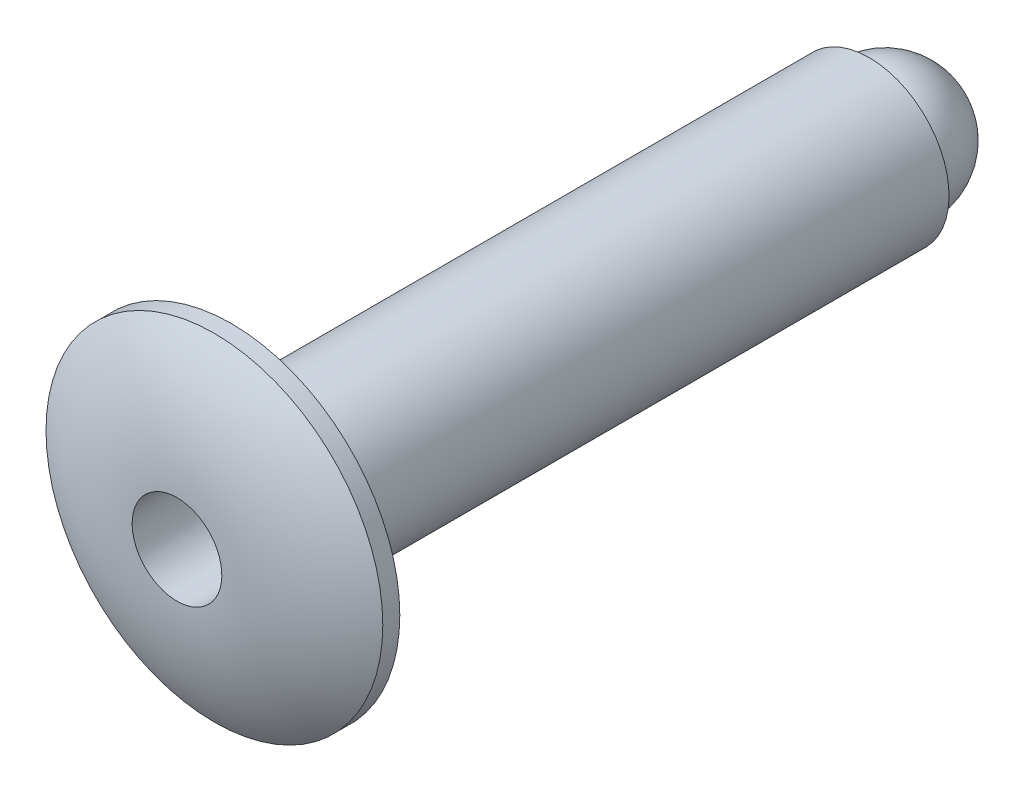
ISO-10303-21;
HEADER;
FILE_DESCRIPTION(('STEP AP214'),'2;1');
FILE_NAME('part.step','',(''),(''),'','','');
FILE_SCHEMA(('AUTOMOTIVE_DESIGN { 1 0 10303 214 1 1 1 1 }'));
ENDSEC;
DATA;
#1=APPLICATION_CONTEXT('core data for automotive mechanical design processes');
#2=APPLICATION_PROTOCOL_DEFINITION('international standard','automotive_design',2000,#1);
#3=PRODUCT_CONTEXT('',#1,'mechanical');
#4=PRODUCT('Part','Part','',(#3));
#5=PRODUCT_RELATED_PRODUCT_CATEGORY('part','',(#4));
#6=PRODUCT_DEFINITION_FORMATION('','',#4);
#7=PRODUCT_DEFINITION_CONTEXT('part definition',#1,'design');
#8=PRODUCT_DEFINITION('design','',#6,#7);
#9=PRODUCT_DEFINITION_SHAPE('','',#8);
#10=(LENGTH_UNIT() NAMED_UNIT(*) SI_UNIT(.MILLI.,.METRE.));
#11=(NAMED_UNIT(*) PLANE_ANGLE_UNIT() SI_UNIT($,.RADIAN.));
#12=(NAMED_UNIT(*) SI_UNIT($,.STERADIAN.) SOLID_ANGLE_UNIT());
#13=UNCERTAINTY_MEASURE_WITH_UNIT(LENGTH_MEASURE(1.E-05),#10,'distance_accuracy_value','');
#14=(GEOMETRIC_REPRESENTATION_CONTEXT(3) GLOBAL_UNCERTAINTY_ASSIGNED_CONTEXT((#13)) GLOBAL_UNIT_ASSIGNED_CONTEXT((#10,
#11,#12)) REPRESENTATION_CONTEXT('',''));
#15=CARTESIAN_POINT('',(0.,0.,0.));
#16=DIRECTION('',(0.,0.,1.));
#17=DIRECTION('',(1.,0.,0.));
#18=AXIS2_PLACEMENT_3D('',#15,#16,#17);
#19=CARTESIAN_POINT('',(0.,0.,-9.7625296875));
#20=DIRECTION('',(0.,0.,1.));
#21=DIRECTION('',(0.,1.,0.));
#22=AXIS2_PLACEMENT_3D('',#19,#20,#21);
#23=SPHERICAL_SURFACE('',#22,0.9816703125);
#24=CARTESIAN_POINT('',(0.,0.,-9.525));
#25=DIRECTION('',(0.,0.,1.));
#26=DIRECTION('',(1.,0.,0.));
#27=AXIS2_PLACEMENT_3D('',#24,#25,#26);
#28=CIRCLE('',#27,0.9525);
#29=CARTESIAN_POINT('',(0.9525,0.,-9.525));
#30=VERTEX_POINT('',#29);
#31=EDGE_CURVE('E11',#30,#30,#28,.T.);
#32=ORIENTED_EDGE('',*,*,#31,.F.);
#33=EDGE_LOOP('',(#32));
#34=FACE_BOUND('',#33,.T.);
#35=ADVANCED_FACE('F43',(#34),#23,.T.);
#36=CARTESIAN_POINT('',(0.,0.9525,-9.525));
#37=DIRECTION('',(0.,0.,-1.));
#38=DIRECTION('',(-1.,0.,0.));
#39=AXIS2_PLACEMENT_3D('',#36,#37,#38);
#40=PLANE('',#39);
#41=ORIENTED_EDGE('',*,*,#31,.T.);
#42=EDGE_LOOP('',(#41));
#43=FACE_BOUND('',#42,.T.);
#44=ADVANCED_FACE('F50',(#43),#40,.F.);
#45=CLOSED_SHELL('',(#35,#44));
#46=MANIFOLD_SOLID_BREP('B2',#45);
#47=CARTESIAN_POINT('',(0.,0.,-9.525));
#48=DIRECTION('',(0.,0.,-1.));
#49=DIRECTION('',(0.,1.,0.));
#50=AXIS2_PLACEMENT_3D('',#47,#48,#49);
#51=CYLINDRICAL_SURFACE('',#50,2.5146);
#52=CARTESIAN_POINT('',(0.,0.,0.253999999999999));
#53=DIRECTION('',(0.,0.,-1.));
#54=DIRECTION('',(0.,1.,0.));
#55=AXIS2_PLACEMENT_3D('',#52,#53,#54);
#56=CIRCLE('',#55,2.5146);
#57=CARTESIAN_POINT('',(0.,2.5146,0.253999999999999));
#58=VERTEX_POINT('',#57);
#59=EDGE_CURVE('E80',#58,#58,#56,.T.);
#60=ORIENTED_EDGE('',*,*,#59,.T.);
#61=EDGE_LOOP('',(#60));
#62=FACE_BOUND('',#61,.T.);
#63=CARTESIAN_POINT('',(0.,0.,0.));
#64=DIRECTION('',(0.,0.,-1.));
#65=DIRECTION('',(0.,1.,0.));
#66=AXIS2_PLACEMENT_3D('',#63,#64,#65);
#67=CIRCLE('',#66,2.5146);
#68=CARTESIAN_POINT('',(0.,2.5146,0.));
#69=VERTEX_POINT('',#68);
#70=EDGE_CURVE('E95',#69,#69,#67,.T.);
#71=ORIENTED_EDGE('',*,*,#70,.F.);
#72=EDGE_LOOP('',(#71));
#73=FACE_BOUND('',#72,.T.);
#74=ADVANCED_FACE('F69',(#62,#73),#51,.T.);
#75=CARTESIAN_POINT('',(0.,0.,-2.51201696527654));
#76=DIRECTION('',(0.,0.,-1.));
#77=DIRECTION('',(0.,1.,0.));
#78=AXIS2_PLACEMENT_3D('',#75,#76,#77);
#79=DEGENERATE_TOROIDAL_SURFACE('',#78,0.669726562500001,3.32481696527654,.T.);
#80=CARTESIAN_POINT('',(0.,0.,0.812800000000001));
#81=DIRECTION('',(0.,0.,-1.));
#82=DIRECTION('',(0.,1.,0.));
#83=AXIS2_PLACEMENT_3D('',#80,#81,#82);
#84=CIRCLE('',#83,0.669726562500001);
#85=CARTESIAN_POINT('',(0.,0.6697265625,0.812800000000001));
#86=VERTEX_POINT('',#85);
#87=EDGE_CURVE('E84',#86,#86,#84,.T.);
#88=ORIENTED_EDGE('',*,*,#87,.T.);
#89=EDGE_LOOP('',(#88));
#90=FACE_BOUND('',#89,.T.);
#91=ORIENTED_EDGE('',*,*,#59,.F.);
#92=EDGE_LOOP('',(#91));
#93=FACE_BOUND('',#92,.T.);
#94=ADVANCED_FACE('F102',(#90,#93),#79,.T.);
#95=CARTESIAN_POINT('',(0.,0.,-9.525));
#96=DIRECTION('',(0.,0.,-1.));
#97=DIRECTION('',(0.,1.,0.));
#98=AXIS2_PLACEMENT_3D('',#95,#96,#97);
#99=CYLINDRICAL_SURFACE('',#98,0.669726562500001);
#100=CARTESIAN_POINT('',(0.,0.,-0.9525));
#101=DIRECTION('',(0.,0.,-1.));
#102=DIRECTION('',(0.,1.,0.));
#103=AXIS2_PLACEMENT_3D('',#100,#101,#102);
#104=CIRCLE('',#103,0.669726562500001);
#105=CARTESIAN_POINT('',(0.,0.6697265625,-0.9525));
#106=VERTEX_POINT('',#105);
#107=EDGE_CURVE('E89',#106,#106,#104,.T.);
#108=ORIENTED_EDGE('',*,*,#107,.T.);
#109=EDGE_LOOP('',(#108));
#110=FACE_BOUND('',#109,.T.);
#111=ORIENTED_EDGE('',*,*,#87,.F.);
#112=EDGE_LOOP('',(#111));
#113=FACE_BOUND('',#112,.T.);
#114=ADVANCED_FACE('F107',(#110,#113),#99,.F.);
#115=CARTESIAN_POINT('',(0.,0.6697265625,-0.9525));
#116=DIRECTION('',(0.,0.,1.));
#117=DIRECTION('',(0.,-1.,0.));
#118=AXIS2_PLACEMENT_3D('',#115,#116,#117);
#119=PLANE('',#118);
#120=ORIENTED_EDGE('',*,*,#107,.F.);
#121=EDGE_LOOP('',(#120));
#122=FACE_BOUND('',#121,.T.);
#123=ADVANCED_FACE('F113',(#122),#119,.T.);
#124=CARTESIAN_POINT('',(0.,1.190625,-9.525));
#125=DIRECTION('',(0.,0.,-1.));
#126=DIRECTION('',(0.,1.,0.));
#127=AXIS2_PLACEMENT_3D('',#124,#125,#126);
#128=PLANE('',#127);
#129=CARTESIAN_POINT('',(0.,0.,-9.525));
#130=DIRECTION('',(0.,0.,-1.));
#131=DIRECTION('',(0.,1.,0.));
#132=AXIS2_PLACEMENT_3D('',#129,#130,#131);
#133=CIRCLE('',#132,1.190625);
#134=CARTESIAN_POINT('',(0.,1.190625,-9.525));
#135=VERTEX_POINT('',#134);
#136=EDGE_CURVE('E92',#135,#135,#133,.T.);
#137=ORIENTED_EDGE('',*,*,#136,.T.);
#138=EDGE_LOOP('',(#137));
#139=FACE_BOUND('',#138,.T.);
#140=ADVANCED_FACE('F117',(#139),#128,.T.);
#141=CARTESIAN_POINT('',(0.,0.,-9.525));
#142=DIRECTION('',(0.,0.,-1.));
#143=DIRECTION('',(0.,1.,0.));
#144=AXIS2_PLACEMENT_3D('',#141,#142,#143);
#145=CYLINDRICAL_SURFACE('',#144,1.190625);
#146=CARTESIAN_POINT('',(0.,0.,-0.254000000000001));
#147=DIRECTION('',(0.,0.,-1.));
#148=DIRECTION('',(0.,1.,0.));
#149=AXIS2_PLACEMENT_3D('',#146,#147,#148);
#150=CIRCLE('',#149,1.190625);
#151=CARTESIAN_POINT('',(0.,1.190625,-0.254000000000001));
#152=VERTEX_POINT('',#151);
#153=EDGE_CURVE('E76',#152,#152,#150,.T.);
#154=ORIENTED_EDGE('',*,*,#153,.T.);
#155=EDGE_LOOP('',(#154));
#156=FACE_BOUND('',#155,.T.);
#157=ORIENTED_EDGE('',*,*,#136,.F.);
#158=EDGE_LOOP('',(#157));
#159=FACE_BOUND('',#158,.T.);
#160=ADVANCED_FACE('F121',(#156,#159),#145,.T.);
#161=CARTESIAN_POINT('',(0.,1.190625,0.));
#162=DIRECTION('',(0.,0.,-1.));
#163=DIRECTION('',(0.,1.,0.));
#164=AXIS2_PLACEMENT_3D('',#161,#162,#163);
#165=PLANE('',#164);
#166=CARTESIAN_POINT('',(0.,0.,0.));
#167=DIRECTION('',(0.,0.,-1.));
#168=DIRECTION('',(0.,1.,0.));
#169=AXIS2_PLACEMENT_3D('',#166,#167,#168);
#170=CIRCLE('',#169,1.444625);
#171=CARTESIAN_POINT('',(0.,1.444625,0.));
#172=VERTEX_POINT('',#171);
#173=EDGE_CURVE('E42',#172,#172,#170,.F.);
#174=ORIENTED_EDGE('',*,*,#173,.T.);
#175=EDGE_LOOP('',(#174));
#176=FACE_BOUND('',#175,.T.);
#177=ORIENTED_EDGE('',*,*,#70,.T.);
#178=EDGE_LOOP('',(#177));
#179=FACE_BOUND('',#178,.T.);
#180=ADVANCED_FACE('F99',(#176,#179),#165,.T.);
#181=CARTESIAN_POINT('',(0.,0.,-0.254000000000001));
#182=DIRECTION('',(0.,0.,-1.));
#183=DIRECTION('',(0.,1.,0.));
#184=AXIS2_PLACEMENT_3D('',#181,#182,#183);
#185=TOROIDAL_SURFACE('',#184,1.444625,0.254);
#186=ORIENTED_EDGE('',*,*,#173,.F.);
#187=EDGE_LOOP('',(#186));
#188=FACE_BOUND('',#187,.T.);
#189=ORIENTED_EDGE('',*,*,#153,.F.);
#190=EDGE_LOOP('',(#189));
#191=FACE_BOUND('',#190,.T.);
#192=ADVANCED_FACE('F71',(#188,#191),#185,.F.);
#193=CLOSED_SHELL('',(#74,#94,#114,#123,#140,#160,#180,#192));
#194=MANIFOLD_SOLID_BREP('B6',#193);
#195=ADVANCED_BREP_SHAPE_REPRESENTATION('',(#18,#46,#194),#14);
#196=SHAPE_DEFINITION_REPRESENTATION(#9,#195);
ENDSEC;
END-ISO-10303-21;
